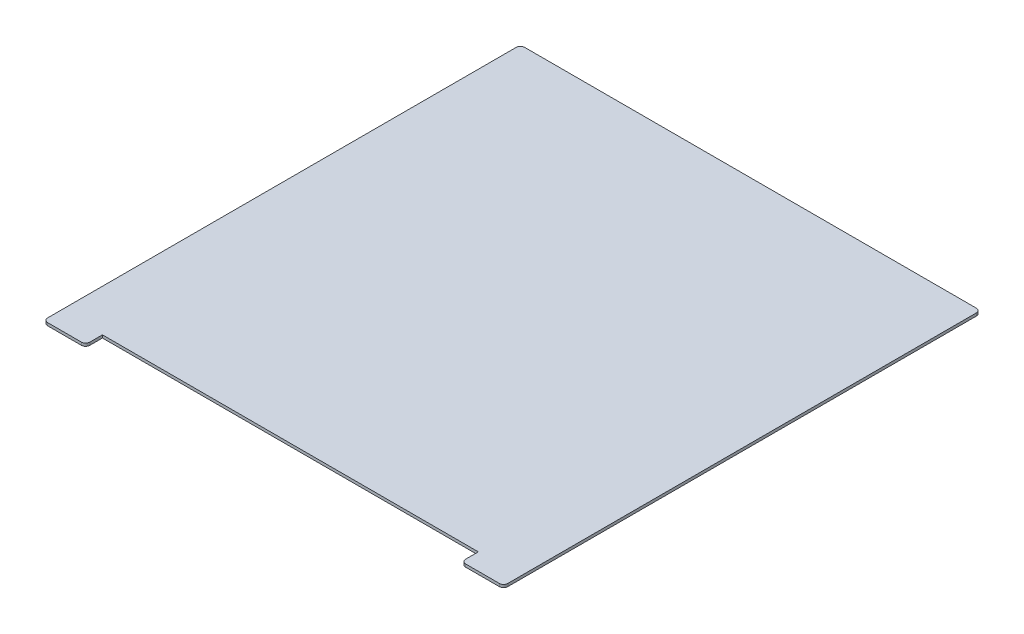
ISO-10303-21;
HEADER;
FILE_DESCRIPTION(('STEP AP214'),'2;1');
FILE_NAME('part.step','',(''),(''),'','','');
FILE_SCHEMA(('AUTOMOTIVE_DESIGN { 1 0 10303 214 1 1 1 1 }'));
ENDSEC;
DATA;
#1=APPLICATION_CONTEXT('core data for automotive mechanical design processes');
#2=APPLICATION_PROTOCOL_DEFINITION('international standard','automotive_design',2000,#1);
#3=PRODUCT_CONTEXT('',#1,'mechanical');
#4=PRODUCT('Part','Part','',(#3));
#5=PRODUCT_RELATED_PRODUCT_CATEGORY('part','',(#4));
#6=PRODUCT_DEFINITION_FORMATION('','',#4);
#7=PRODUCT_DEFINITION_CONTEXT('part definition',#1,'design');
#8=PRODUCT_DEFINITION('design','',#6,#7);
#9=PRODUCT_DEFINITION_SHAPE('','',#8);
#10=(LENGTH_UNIT() NAMED_UNIT(*) SI_UNIT(.MILLI.,.METRE.));
#11=(NAMED_UNIT(*) PLANE_ANGLE_UNIT() SI_UNIT($,.RADIAN.));
#12=(NAMED_UNIT(*) SI_UNIT($,.STERADIAN.) SOLID_ANGLE_UNIT());
#13=UNCERTAINTY_MEASURE_WITH_UNIT(LENGTH_MEASURE(1.E-05),#10,'distance_accuracy_value','');
#14=(GEOMETRIC_REPRESENTATION_CONTEXT(3) GLOBAL_UNCERTAINTY_ASSIGNED_CONTEXT((#13)) GLOBAL_UNIT_ASSIGNED_CONTEXT((#10,
#11,#12)) REPRESENTATION_CONTEXT('',''));
#15=CARTESIAN_POINT('',(0.,0.,0.));
#16=DIRECTION('',(0.,0.,1.));
#17=DIRECTION('',(1.,0.,0.));
#18=AXIS2_PLACEMENT_3D('',#15,#16,#17);
#19=CARTESIAN_POINT('',(-298.,2.,-142.350253807107));
#20=DIRECTION('',(1.,0.,0.));
#21=DIRECTION('',(0.,0.,-1.));
#22=AXIS2_PLACEMENT_3D('',#19,#20,#21);
#23=PLANE('',#22);
#24=DIRECTION('',(0.,0.,1.));
#25=VECTOR('',#24,1.);
#26=CARTESIAN_POINT('',(-298.,2.,-142.350253807107));
#27=LINE('',#26,#25);
#28=CARTESIAN_POINT('',(-298.,2.,-139.350253807107));
#29=VERTEX_POINT('',#28);
#30=CARTESIAN_POINT('',(-298.,2.,194.649746192893));
#31=VERTEX_POINT('',#30);
#32=EDGE_CURVE('E193',#29,#31,#27,.T.);
#33=ORIENTED_EDGE('',*,*,#32,.F.);
#34=DIRECTION('',(0.,-1.,0.));
#35=VECTOR('',#34,1.);
#36=CARTESIAN_POINT('',(-298.,2.,-139.350253807107));
#37=LINE('',#36,#35);
#38=CARTESIAN_POINT('',(-298.,0.,-139.350253807107));
#39=VERTEX_POINT('',#38);
#40=EDGE_CURVE('E228',#29,#39,#37,.T.);
#41=ORIENTED_EDGE('',*,*,#40,.T.);
#42=DIRECTION('',(0.,0.,1.));
#43=VECTOR('',#42,1.);
#44=CARTESIAN_POINT('',(-298.,0.,-142.350253807107));
#45=LINE('',#44,#43);
#46=CARTESIAN_POINT('',(-298.,0.,194.649746192893));
#47=VERTEX_POINT('',#46);
#48=EDGE_CURVE('E173',#39,#47,#45,.T.);
#49=ORIENTED_EDGE('',*,*,#48,.T.);
#50=DIRECTION('',(0.,-1.,0.));
#51=VECTOR('',#50,1.);
#52=CARTESIAN_POINT('',(-298.,2.,194.649746192893));
#53=LINE('',#52,#51);
#54=EDGE_CURVE('E226',#47,#31,#53,.F.);
#55=ORIENTED_EDGE('',*,*,#54,.T.);
#56=EDGE_LOOP('',(#33,#41,#49,#55));
#57=FACE_BOUND('',#56,.T.);
#58=ADVANCED_FACE('F34',(#57),#23,.F.);
#59=CARTESIAN_POINT('',(-298.,2.,197.649746192893));
#60=DIRECTION('',(0.,0.,-1.));
#61=DIRECTION('',(-1.,0.,0.));
#62=AXIS2_PLACEMENT_3D('',#59,#60,#61);
#63=PLANE('',#62);
#64=DIRECTION('',(1.,0.,0.));
#65=VECTOR('',#64,1.);
#66=CARTESIAN_POINT('',(-298.,0.,197.649746192893));
#67=LINE('',#66,#65);
#68=CARTESIAN_POINT('',(-295.,0.,197.649746192893));
#69=VERTEX_POINT('',#68);
#70=CARTESIAN_POINT('',(-271.,0.,197.649746192893));
#71=VERTEX_POINT('',#70);
#72=EDGE_CURVE('E176',#69,#71,#67,.T.);
#73=ORIENTED_EDGE('',*,*,#72,.T.);
#74=DIRECTION('',(0.,-1.,0.));
#75=VECTOR('',#74,1.);
#76=CARTESIAN_POINT('',(-271.,2.,197.649746192893));
#77=LINE('',#76,#75);
#78=CARTESIAN_POINT('',(-271.,2.,197.649746192893));
#79=VERTEX_POINT('',#78);
#80=EDGE_CURVE('E236',#71,#79,#77,.F.);
#81=ORIENTED_EDGE('',*,*,#80,.T.);
#82=DIRECTION('',(1.,0.,0.));
#83=VECTOR('',#82,1.);
#84=CARTESIAN_POINT('',(-298.,2.,197.649746192893));
#85=LINE('',#84,#83);
#86=CARTESIAN_POINT('',(-295.,2.,197.649746192893));
#87=VERTEX_POINT('',#86);
#88=EDGE_CURVE('E146',#87,#79,#85,.T.);
#89=ORIENTED_EDGE('',*,*,#88,.F.);
#90=DIRECTION('',(0.,-1.,0.));
#91=VECTOR('',#90,1.);
#92=CARTESIAN_POINT('',(-295.,2.,197.649746192893));
#93=LINE('',#92,#91);
#94=EDGE_CURVE('E233',#87,#69,#93,.T.);
#95=ORIENTED_EDGE('',*,*,#94,.T.);
#96=EDGE_LOOP('',(#73,#81,#89,#95));
#97=FACE_BOUND('',#96,.T.);
#98=ADVANCED_FACE('F292',(#97),#63,.F.);
#99=CARTESIAN_POINT('',(-268.,2.,197.649746192893));
#100=DIRECTION('',(-1.,0.,0.));
#101=DIRECTION('',(0.,0.,1.));
#102=AXIS2_PLACEMENT_3D('',#99,#100,#101);
#103=PLANE('',#102);
#104=DIRECTION('',(0.,0.,-1.));
#105=VECTOR('',#104,1.);
#106=CARTESIAN_POINT('',(-268.,2.,197.649746192893));
#107=LINE('',#106,#105);
#108=CARTESIAN_POINT('',(-268.,2.,194.649746192893));
#109=VERTEX_POINT('',#108);
#110=CARTESIAN_POINT('',(-268.,2.,185.649746192893));
#111=VERTEX_POINT('',#110);
#112=EDGE_CURVE('E133',#109,#111,#107,.T.);
#113=ORIENTED_EDGE('',*,*,#112,.F.);
#114=DIRECTION('',(0.,-1.,0.));
#115=VECTOR('',#114,1.);
#116=CARTESIAN_POINT('',(-268.,2.,194.649746192893));
#117=LINE('',#116,#115);
#118=CARTESIAN_POINT('',(-268.,0.,194.649746192893));
#119=VERTEX_POINT('',#118);
#120=EDGE_CURVE('E231',#109,#119,#117,.T.);
#121=ORIENTED_EDGE('',*,*,#120,.T.);
#122=DIRECTION('',(0.,0.,-1.));
#123=VECTOR('',#122,1.);
#124=CARTESIAN_POINT('',(-268.,0.,197.649746192893));
#125=LINE('',#124,#123);
#126=CARTESIAN_POINT('',(-268.,0.,185.649746192893));
#127=VERTEX_POINT('',#126);
#128=EDGE_CURVE('E152',#119,#127,#125,.T.);
#129=ORIENTED_EDGE('',*,*,#128,.T.);
#130=DIRECTION('',(0.,-1.,0.));
#131=VECTOR('',#130,1.);
#132=CARTESIAN_POINT('',(-268.,2.,185.649746192893));
#133=LINE('',#132,#131);
#134=EDGE_CURVE('E149',#111,#127,#133,.T.);
#135=ORIENTED_EDGE('',*,*,#134,.F.);
#136=EDGE_LOOP('',(#113,#121,#129,#135));
#137=FACE_BOUND('',#136,.T.);
#138=ADVANCED_FACE('F150',(#137),#103,.F.);
#139=CARTESIAN_POINT('',(-268.,2.,185.649746192893));
#140=DIRECTION('',(0.,0.,-1.));
#141=DIRECTION('',(-1.,0.,0.));
#142=AXIS2_PLACEMENT_3D('',#139,#140,#141);
#143=PLANE('',#142);
#144=DIRECTION('',(1.,0.,0.));
#145=VECTOR('',#144,1.);
#146=CARTESIAN_POINT('',(-268.,0.,185.649746192893));
#147=LINE('',#146,#145);
#148=CARTESIAN_POINT('',(0.,0.,185.649746192893));
#149=VERTEX_POINT('',#148);
#150=EDGE_CURVE('E180',#127,#149,#147,.T.);
#151=ORIENTED_EDGE('',*,*,#150,.T.);
#152=DIRECTION('',(0.,-1.,0.));
#153=VECTOR('',#152,1.);
#154=CARTESIAN_POINT('',(0.,2.,185.649746192893));
#155=LINE('',#154,#153);
#156=CARTESIAN_POINT('',(0.,2.,185.649746192893));
#157=VERTEX_POINT('',#156);
#158=EDGE_CURVE('E156',#157,#149,#155,.T.);
#159=ORIENTED_EDGE('',*,*,#158,.F.);
#160=DIRECTION('',(1.,0.,0.));
#161=VECTOR('',#160,1.);
#162=CARTESIAN_POINT('',(-268.,2.,185.649746192893));
#163=LINE('',#162,#161);
#164=EDGE_CURVE('E138',#111,#157,#163,.T.);
#165=ORIENTED_EDGE('',*,*,#164,.F.);
#166=ORIENTED_EDGE('',*,*,#134,.T.);
#167=EDGE_LOOP('',(#151,#159,#165,#166));
#168=FACE_BOUND('',#167,.T.);
#169=ADVANCED_FACE('F158',(#168),#143,.F.);
#170=CARTESIAN_POINT('',(0.,2.,185.649746192893));
#171=DIRECTION('',(1.,0.,0.));
#172=DIRECTION('',(0.,0.,-1.));
#173=AXIS2_PLACEMENT_3D('',#170,#171,#172);
#174=PLANE('',#173);
#175=DIRECTION('',(0.,0.,1.));
#176=VECTOR('',#175,1.);
#177=CARTESIAN_POINT('',(0.,0.,185.649746192893));
#178=LINE('',#177,#176);
#179=CARTESIAN_POINT('',(0.,0.,194.649746192893));
#180=VERTEX_POINT('',#179);
#181=EDGE_CURVE('E182',#149,#180,#178,.T.);
#182=ORIENTED_EDGE('',*,*,#181,.T.);
#183=DIRECTION('',(0.,-1.,0.));
#184=VECTOR('',#183,1.);
#185=CARTESIAN_POINT('',(0.,2.,194.649746192893));
#186=LINE('',#185,#184);
#187=CARTESIAN_POINT('',(0.,2.,194.649746192893));
#188=VERTEX_POINT('',#187);
#189=EDGE_CURVE('E11',#180,#188,#186,.F.);
#190=ORIENTED_EDGE('',*,*,#189,.T.);
#191=DIRECTION('',(0.,0.,1.));
#192=VECTOR('',#191,1.);
#193=CARTESIAN_POINT('',(0.,2.,185.649746192893));
#194=LINE('',#193,#192);
#195=EDGE_CURVE('E161',#157,#188,#194,.T.);
#196=ORIENTED_EDGE('',*,*,#195,.F.);
#197=ORIENTED_EDGE('',*,*,#158,.T.);
#198=EDGE_LOOP('',(#182,#190,#196,#197));
#199=FACE_BOUND('',#198,.T.);
#200=ADVANCED_FACE('F284',(#199),#174,.F.);
#201=CARTESIAN_POINT('',(0.,2.,197.649746192893));
#202=DIRECTION('',(0.,0.,-1.));
#203=DIRECTION('',(-1.,0.,0.));
#204=AXIS2_PLACEMENT_3D('',#201,#202,#203);
#205=PLANE('',#204);
#206=DIRECTION('',(1.,0.,0.));
#207=VECTOR('',#206,1.);
#208=CARTESIAN_POINT('',(0.,0.,197.649746192893));
#209=LINE('',#208,#207);
#210=CARTESIAN_POINT('',(3.,0.,197.649746192893));
#211=VERTEX_POINT('',#210);
#212=CARTESIAN_POINT('',(27.,0.,197.649746192893));
#213=VERTEX_POINT('',#212);
#214=EDGE_CURVE('E185',#211,#213,#209,.T.);
#215=ORIENTED_EDGE('',*,*,#214,.T.);
#216=DIRECTION('',(0.,-1.,0.));
#217=VECTOR('',#216,1.);
#218=CARTESIAN_POINT('',(27.,2.,197.649746192893));
#219=LINE('',#218,#217);
#220=CARTESIAN_POINT('',(27.,2.,197.649746192893));
#221=VERTEX_POINT('',#220);
#222=EDGE_CURVE('E42',#213,#221,#219,.F.);
#223=ORIENTED_EDGE('',*,*,#222,.T.);
#224=DIRECTION('',(1.,0.,0.));
#225=VECTOR('',#224,1.);
#226=CARTESIAN_POINT('',(0.,2.,197.649746192893));
#227=LINE('',#226,#225);
#228=CARTESIAN_POINT('',(3.,2.,197.649746192893));
#229=VERTEX_POINT('',#228);
#230=EDGE_CURVE('E163',#229,#221,#227,.T.);
#231=ORIENTED_EDGE('',*,*,#230,.F.);
#232=DIRECTION('',(0.,-1.,0.));
#233=VECTOR('',#232,1.);
#234=CARTESIAN_POINT('',(3.,2.,197.649746192893));
#235=LINE('',#234,#233);
#236=EDGE_CURVE('E238',#229,#211,#235,.T.);
#237=ORIENTED_EDGE('',*,*,#236,.T.);
#238=EDGE_LOOP('',(#215,#223,#231,#237));
#239=FACE_BOUND('',#238,.T.);
#240=ADVANCED_FACE('F242',(#239),#205,.F.);
#241=CARTESIAN_POINT('',(30.,2.,-142.350253807107));
#242=DIRECTION('',(-1.,0.,0.));
#243=DIRECTION('',(0.,0.,1.));
#244=AXIS2_PLACEMENT_3D('',#241,#242,#243);
#245=PLANE('',#244);
#246=DIRECTION('',(0.,0.,-1.));
#247=VECTOR('',#246,1.);
#248=CARTESIAN_POINT('',(30.,0.,-142.350253807107));
#249=LINE('',#248,#247);
#250=CARTESIAN_POINT('',(30.,0.,194.649746192893));
#251=VERTEX_POINT('',#250);
#252=CARTESIAN_POINT('',(30.,0.,-139.350253807107));
#253=VERTEX_POINT('',#252);
#254=EDGE_CURVE('E187',#251,#253,#249,.T.);
#255=ORIENTED_EDGE('',*,*,#254,.T.);
#256=DIRECTION('',(0.,-1.,0.));
#257=VECTOR('',#256,1.);
#258=CARTESIAN_POINT('',(30.,2.,-139.350253807107));
#259=LINE('',#258,#257);
#260=CARTESIAN_POINT('',(30.,2.,-139.350253807107));
#261=VERTEX_POINT('',#260);
#262=EDGE_CURVE('E214',#253,#261,#259,.F.);
#263=ORIENTED_EDGE('',*,*,#262,.T.);
#264=DIRECTION('',(0.,0.,-1.));
#265=VECTOR('',#264,1.);
#266=CARTESIAN_POINT('',(30.,2.,-142.350253807107));
#267=LINE('',#266,#265);
#268=CARTESIAN_POINT('',(30.,2.,194.649746192893));
#269=VERTEX_POINT('',#268);
#270=EDGE_CURVE('E168',#269,#261,#267,.T.);
#271=ORIENTED_EDGE('',*,*,#270,.F.);
#272=DIRECTION('',(0.,-1.,0.));
#273=VECTOR('',#272,1.);
#274=CARTESIAN_POINT('',(30.,2.,194.649746192893));
#275=LINE('',#274,#273);
#276=EDGE_CURVE('E211',#269,#251,#275,.T.);
#277=ORIENTED_EDGE('',*,*,#276,.T.);
#278=EDGE_LOOP('',(#255,#263,#271,#277));
#279=FACE_BOUND('',#278,.T.);
#280=ADVANCED_FACE('F255',(#279),#245,.F.);
#281=CARTESIAN_POINT('',(-298.,2.,-142.350253807107));
#282=DIRECTION('',(0.,0.,1.));
#283=DIRECTION('',(1.,0.,0.));
#284=AXIS2_PLACEMENT_3D('',#281,#282,#283);
#285=PLANE('',#284);
#286=DIRECTION('',(-1.,0.,0.));
#287=VECTOR('',#286,1.);
#288=CARTESIAN_POINT('',(-298.,2.,-142.350253807107));
#289=LINE('',#288,#287);
#290=CARTESIAN_POINT('',(27.,2.,-142.350253807107));
#291=VERTEX_POINT('',#290);
#292=CARTESIAN_POINT('',(-295.,2.,-142.350253807107));
#293=VERTEX_POINT('',#292);
#294=EDGE_CURVE('E170',#291,#293,#289,.T.);
#295=ORIENTED_EDGE('',*,*,#294,.F.);
#296=DIRECTION('',(0.,-1.,0.));
#297=VECTOR('',#296,1.);
#298=CARTESIAN_POINT('',(27.,2.,-142.350253807107));
#299=LINE('',#298,#297);
#300=CARTESIAN_POINT('',(27.,0.,-142.350253807107));
#301=VERTEX_POINT('',#300);
#302=EDGE_CURVE('E196',#291,#301,#299,.T.);
#303=ORIENTED_EDGE('',*,*,#302,.T.);
#304=DIRECTION('',(-1.,0.,0.));
#305=VECTOR('',#304,1.);
#306=CARTESIAN_POINT('',(-298.,0.,-142.350253807107));
#307=LINE('',#306,#305);
#308=CARTESIAN_POINT('',(-295.,0.,-142.350253807107));
#309=VERTEX_POINT('',#308);
#310=EDGE_CURVE('E190',#301,#309,#307,.T.);
#311=ORIENTED_EDGE('',*,*,#310,.T.);
#312=DIRECTION('',(0.,-1.,0.));
#313=VECTOR('',#312,1.);
#314=CARTESIAN_POINT('',(-295.,2.,-142.350253807107));
#315=LINE('',#314,#313);
#316=EDGE_CURVE('E155',#309,#293,#315,.F.);
#317=ORIENTED_EDGE('',*,*,#316,.T.);
#318=EDGE_LOOP('',(#295,#303,#311,#317));
#319=FACE_BOUND('',#318,.T.);
#320=ADVANCED_FACE('F263',(#319),#285,.F.);
#321=CARTESIAN_POINT('',(0.,2.,0.));
#322=DIRECTION('',(0.,1.,0.));
#323=DIRECTION('',(0.,0.,1.));
#324=AXIS2_PLACEMENT_3D('',#321,#322,#323);
#325=PLANE('',#324);
#326=ORIENTED_EDGE('',*,*,#270,.T.);
#327=CARTESIAN_POINT('',(27.,2.,-139.350253807107));
#328=DIRECTION('',(0.,1.,0.));
#329=DIRECTION('',(0.,0.,1.));
#330=AXIS2_PLACEMENT_3D('',#327,#328,#329);
#331=CIRCLE('',#330,3.);
#332=EDGE_CURVE('E224',#261,#291,#331,.T.);
#333=ORIENTED_EDGE('',*,*,#332,.T.);
#334=ORIENTED_EDGE('',*,*,#294,.T.);
#335=CARTESIAN_POINT('',(-295.,2.,-139.350253807107));
#336=DIRECTION('',(0.,1.,0.));
#337=DIRECTION('',(0.,0.,1.));
#338=AXIS2_PLACEMENT_3D('',#335,#336,#337);
#339=CIRCLE('',#338,3.);
#340=EDGE_CURVE('E222',#293,#29,#339,.T.);
#341=ORIENTED_EDGE('',*,*,#340,.T.);
#342=ORIENTED_EDGE('',*,*,#32,.T.);
#343=CARTESIAN_POINT('',(-295.,2.,194.649746192893));
#344=DIRECTION('',(0.,1.,0.));
#345=DIRECTION('',(0.,0.,1.));
#346=AXIS2_PLACEMENT_3D('',#343,#344,#345);
#347=CIRCLE('',#346,3.);
#348=EDGE_CURVE('E219',#31,#87,#347,.T.);
#349=ORIENTED_EDGE('',*,*,#348,.T.);
#350=ORIENTED_EDGE('',*,*,#88,.T.);
#351=CARTESIAN_POINT('',(-271.,2.,194.649746192893));
#352=DIRECTION('',(0.,1.,0.));
#353=DIRECTION('',(0.,0.,1.));
#354=AXIS2_PLACEMENT_3D('',#351,#352,#353);
#355=CIRCLE('',#354,3.);
#356=EDGE_CURVE('E142',#79,#109,#355,.T.);
#357=ORIENTED_EDGE('',*,*,#356,.T.);
#358=ORIENTED_EDGE('',*,*,#112,.T.);
#359=ORIENTED_EDGE('',*,*,#164,.T.);
#360=ORIENTED_EDGE('',*,*,#195,.T.);
#361=CARTESIAN_POINT('',(3.,2.,194.649746192893));
#362=DIRECTION('',(0.,1.,0.));
#363=DIRECTION('',(0.,0.,1.));
#364=AXIS2_PLACEMENT_3D('',#361,#362,#363);
#365=CIRCLE('',#364,3.);
#366=EDGE_CURVE('E55',#188,#229,#365,.T.);
#367=ORIENTED_EDGE('',*,*,#366,.T.);
#368=ORIENTED_EDGE('',*,*,#230,.T.);
#369=CARTESIAN_POINT('',(27.,2.,194.649746192893));
#370=DIRECTION('',(0.,1.,0.));
#371=DIRECTION('',(0.,0.,1.));
#372=AXIS2_PLACEMENT_3D('',#369,#370,#371);
#373=CIRCLE('',#372,3.);
#374=EDGE_CURVE('E217',#221,#269,#373,.T.);
#375=ORIENTED_EDGE('',*,*,#374,.T.);
#376=EDGE_LOOP('',(#326,#333,#334,#341,#342,#349,#350,#357,#358,#359,#360,#367,#368,#375));
#377=FACE_BOUND('',#376,.T.);
#378=ADVANCED_FACE('F136',(#377),#325,.T.);
#379=CARTESIAN_POINT('',(0.,0.,0.));
#380=DIRECTION('',(0.,1.,0.));
#381=DIRECTION('',(0.,0.,1.));
#382=AXIS2_PLACEMENT_3D('',#379,#380,#381);
#383=PLANE('',#382);
#384=ORIENTED_EDGE('',*,*,#310,.F.);
#385=CARTESIAN_POINT('',(27.,0.,-139.350253807107));
#386=DIRECTION('',(0.,1.,0.));
#387=DIRECTION('',(0.,0.,1.));
#388=AXIS2_PLACEMENT_3D('',#385,#386,#387);
#389=CIRCLE('',#388,3.);
#390=EDGE_CURVE('E209',#301,#253,#389,.F.);
#391=ORIENTED_EDGE('',*,*,#390,.T.);
#392=ORIENTED_EDGE('',*,*,#254,.F.);
#393=CARTESIAN_POINT('',(27.,0.,194.649746192893));
#394=DIRECTION('',(0.,1.,0.));
#395=DIRECTION('',(0.,0.,1.));
#396=AXIS2_PLACEMENT_3D('',#393,#394,#395);
#397=CIRCLE('',#396,3.);
#398=EDGE_CURVE('E201',#251,#213,#397,.F.);
#399=ORIENTED_EDGE('',*,*,#398,.T.);
#400=ORIENTED_EDGE('',*,*,#214,.F.);
#401=CARTESIAN_POINT('',(3.,0.,194.649746192893));
#402=DIRECTION('',(0.,1.,0.));
#403=DIRECTION('',(0.,0.,1.));
#404=AXIS2_PLACEMENT_3D('',#401,#402,#403);
#405=CIRCLE('',#404,3.);
#406=EDGE_CURVE('E199',#211,#180,#405,.F.);
#407=ORIENTED_EDGE('',*,*,#406,.T.);
#408=ORIENTED_EDGE('',*,*,#181,.F.);
#409=ORIENTED_EDGE('',*,*,#150,.F.);
#410=ORIENTED_EDGE('',*,*,#128,.F.);
#411=CARTESIAN_POINT('',(-271.,0.,194.649746192893));
#412=DIRECTION('',(0.,1.,0.));
#413=DIRECTION('',(0.,0.,1.));
#414=AXIS2_PLACEMENT_3D('',#411,#412,#413);
#415=CIRCLE('',#414,3.);
#416=EDGE_CURVE('E205',#119,#71,#415,.F.);
#417=ORIENTED_EDGE('',*,*,#416,.T.);
#418=ORIENTED_EDGE('',*,*,#72,.F.);
#419=CARTESIAN_POINT('',(-295.,0.,194.649746192893));
#420=DIRECTION('',(0.,1.,0.));
#421=DIRECTION('',(0.,0.,1.));
#422=AXIS2_PLACEMENT_3D('',#419,#420,#421);
#423=CIRCLE('',#422,3.);
#424=EDGE_CURVE('E203',#69,#47,#423,.F.);
#425=ORIENTED_EDGE('',*,*,#424,.T.);
#426=ORIENTED_EDGE('',*,*,#48,.F.);
#427=CARTESIAN_POINT('',(-295.,0.,-139.350253807107));
#428=DIRECTION('',(0.,1.,0.));
#429=DIRECTION('',(0.,0.,1.));
#430=AXIS2_PLACEMENT_3D('',#427,#428,#429);
#431=CIRCLE('',#430,3.);
#432=EDGE_CURVE('E207',#39,#309,#431,.F.);
#433=ORIENTED_EDGE('',*,*,#432,.T.);
#434=EDGE_LOOP('',(#384,#391,#392,#399,#400,#407,#408,#409,#410,#417,#418,#425,#426,#433));
#435=FACE_BOUND('',#434,.T.);
#436=ADVANCED_FACE('F246',(#435),#383,.F.);
#437=CARTESIAN_POINT('',(27.,2.,-139.350253807107));
#438=DIRECTION('',(0.,-1.,0.));
#439=DIRECTION('',(0.,0.,-1.));
#440=AXIS2_PLACEMENT_3D('',#437,#438,#439);
#441=CYLINDRICAL_SURFACE('',#440,3.);
#442=ORIENTED_EDGE('',*,*,#332,.F.);
#443=ORIENTED_EDGE('',*,*,#262,.F.);
#444=ORIENTED_EDGE('',*,*,#390,.F.);
#445=ORIENTED_EDGE('',*,*,#302,.F.);
#446=EDGE_LOOP('',(#442,#443,#444,#445));
#447=FACE_BOUND('',#446,.T.);
#448=ADVANCED_FACE('F261',(#447),#441,.T.);
#449=CARTESIAN_POINT('',(-295.,2.,-139.350253807107));
#450=DIRECTION('',(0.,-1.,0.));
#451=DIRECTION('',(0.,0.,-1.));
#452=AXIS2_PLACEMENT_3D('',#449,#450,#451);
#453=CYLINDRICAL_SURFACE('',#452,3.);
#454=ORIENTED_EDGE('',*,*,#340,.F.);
#455=ORIENTED_EDGE('',*,*,#316,.F.);
#456=ORIENTED_EDGE('',*,*,#432,.F.);
#457=ORIENTED_EDGE('',*,*,#40,.F.);
#458=EDGE_LOOP('',(#454,#455,#456,#457));
#459=FACE_BOUND('',#458,.T.);
#460=ADVANCED_FACE('F269',(#459),#453,.T.);
#461=CARTESIAN_POINT('',(-271.,2.,194.649746192893));
#462=DIRECTION('',(0.,-1.,0.));
#463=DIRECTION('',(0.,0.,-1.));
#464=AXIS2_PLACEMENT_3D('',#461,#462,#463);
#465=CYLINDRICAL_SURFACE('',#464,3.);
#466=ORIENTED_EDGE('',*,*,#356,.F.);
#467=ORIENTED_EDGE('',*,*,#80,.F.);
#468=ORIENTED_EDGE('',*,*,#416,.F.);
#469=ORIENTED_EDGE('',*,*,#120,.F.);
#470=EDGE_LOOP('',(#466,#467,#468,#469));
#471=FACE_BOUND('',#470,.T.);
#472=ADVANCED_FACE('F281',(#471),#465,.T.);
#473=CARTESIAN_POINT('',(-295.,2.,194.649746192893));
#474=DIRECTION('',(0.,-1.,0.));
#475=DIRECTION('',(0.,0.,-1.));
#476=AXIS2_PLACEMENT_3D('',#473,#474,#475);
#477=CYLINDRICAL_SURFACE('',#476,3.);
#478=ORIENTED_EDGE('',*,*,#348,.F.);
#479=ORIENTED_EDGE('',*,*,#54,.F.);
#480=ORIENTED_EDGE('',*,*,#424,.F.);
#481=ORIENTED_EDGE('',*,*,#94,.F.);
#482=EDGE_LOOP('',(#478,#479,#480,#481));
#483=FACE_BOUND('',#482,.T.);
#484=ADVANCED_FACE('F290',(#483),#477,.T.);
#485=CARTESIAN_POINT('',(27.,2.,194.649746192893));
#486=DIRECTION('',(0.,-1.,0.));
#487=DIRECTION('',(0.,0.,-1.));
#488=AXIS2_PLACEMENT_3D('',#485,#486,#487);
#489=CYLINDRICAL_SURFACE('',#488,3.);
#490=ORIENTED_EDGE('',*,*,#374,.F.);
#491=ORIENTED_EDGE('',*,*,#222,.F.);
#492=ORIENTED_EDGE('',*,*,#398,.F.);
#493=ORIENTED_EDGE('',*,*,#276,.F.);
#494=EDGE_LOOP('',(#490,#491,#492,#493));
#495=FACE_BOUND('',#494,.T.);
#496=ADVANCED_FACE('F252',(#495),#489,.T.);
#497=CARTESIAN_POINT('',(3.,2.,194.649746192893));
#498=DIRECTION('',(0.,-1.,0.));
#499=DIRECTION('',(0.,0.,-1.));
#500=AXIS2_PLACEMENT_3D('',#497,#498,#499);
#501=CYLINDRICAL_SURFACE('',#500,3.);
#502=ORIENTED_EDGE('',*,*,#366,.F.);
#503=ORIENTED_EDGE('',*,*,#189,.F.);
#504=ORIENTED_EDGE('',*,*,#406,.F.);
#505=ORIENTED_EDGE('',*,*,#236,.F.);
#506=EDGE_LOOP('',(#502,#503,#504,#505));
#507=FACE_BOUND('',#506,.T.);
#508=ADVANCED_FACE('F36',(#507),#501,.T.);
#509=CLOSED_SHELL('',(#58,#98,#138,#169,#200,#240,#280,#320,#378,#436,#448,#460,#472,#484,#496,#508));
#510=MANIFOLD_SOLID_BREP('B2',#509);
#511=ADVANCED_BREP_SHAPE_REPRESENTATION('',(#18,#510),#14);
#512=SHAPE_DEFINITION_REPRESENTATION(#9,#511);
ENDSEC;
END-ISO-10303-21;
